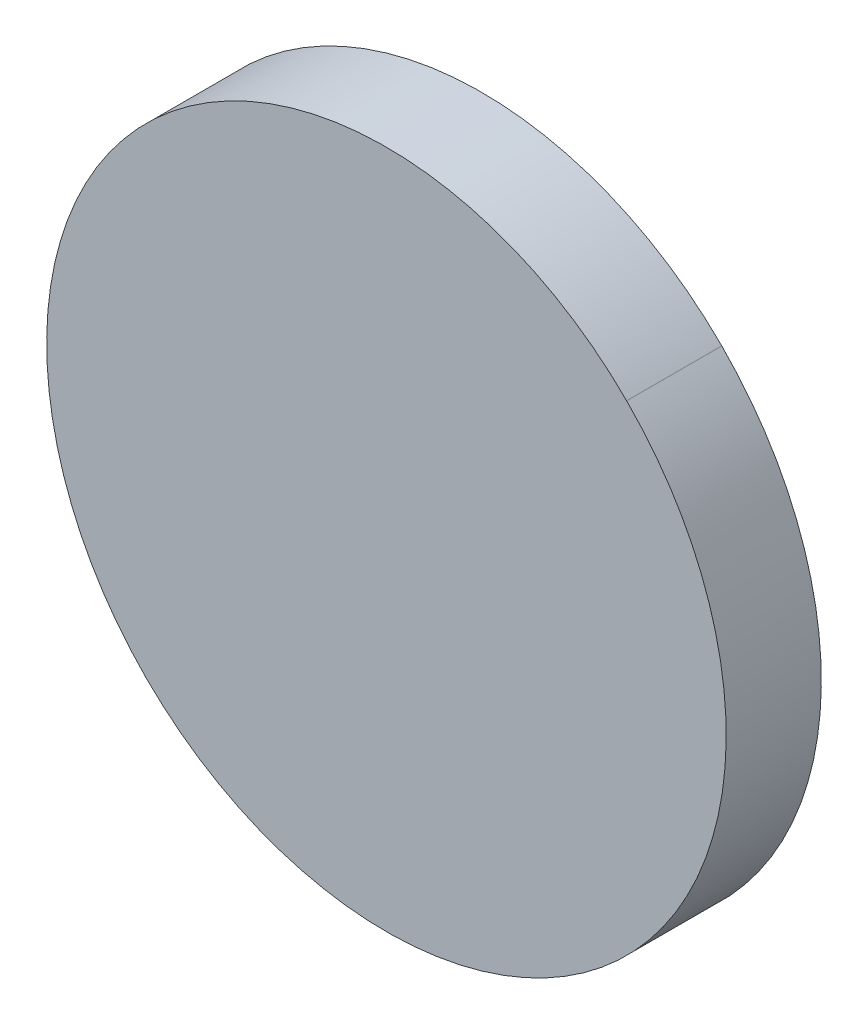
ISO-10303-21;
HEADER;
FILE_DESCRIPTION(('STEP AP214'),'2;1');
FILE_NAME('part.step','',(''),(''),'','','');
FILE_SCHEMA(('AUTOMOTIVE_DESIGN { 1 0 10303 214 1 1 1 1 }'));
ENDSEC;
DATA;
#1=APPLICATION_CONTEXT('core data for automotive mechanical design processes');
#2=APPLICATION_PROTOCOL_DEFINITION('international standard','automotive_design',2000,#1);
#3=PRODUCT_CONTEXT('',#1,'mechanical');
#4=PRODUCT('Part','Part','',(#3));
#5=PRODUCT_RELATED_PRODUCT_CATEGORY('part','',(#4));
#6=PRODUCT_DEFINITION_FORMATION('','',#4);
#7=PRODUCT_DEFINITION_CONTEXT('part definition',#1,'design');
#8=PRODUCT_DEFINITION('design','',#6,#7);
#9=PRODUCT_DEFINITION_SHAPE('','',#8);
#10=(LENGTH_UNIT() NAMED_UNIT(*) SI_UNIT(.MILLI.,.METRE.));
#11=(NAMED_UNIT(*) PLANE_ANGLE_UNIT() SI_UNIT($,.RADIAN.));
#12=(NAMED_UNIT(*) SI_UNIT($,.STERADIAN.) SOLID_ANGLE_UNIT());
#13=UNCERTAINTY_MEASURE_WITH_UNIT(LENGTH_MEASURE(1.E-05),#10,'distance_accuracy_value','');
#14=(GEOMETRIC_REPRESENTATION_CONTEXT(3) GLOBAL_UNCERTAINTY_ASSIGNED_CONTEXT((#13)) GLOBAL_UNIT_ASSIGNED_CONTEXT((#10,
#11,#12)) REPRESENTATION_CONTEXT('',''));
#15=CARTESIAN_POINT('',(0.,0.,0.));
#16=DIRECTION('',(0.,0.,1.));
#17=DIRECTION('',(1.,0.,0.));
#18=AXIS2_PLACEMENT_3D('',#15,#16,#17);
#19=CARTESIAN_POINT('',(93.32717174,92.59717066,0.));
#20=DIRECTION('',(0.707106781186548,0.707106781186548,0.));
#21=DIRECTION('',(0.707106781186548,-0.707106781186548,0.));
#22=AXIS2_PLACEMENT_3D('',#19,#20,#21);
#23=PLANE('',#22);
#24=DIRECTION('',(0.707106781186548,-0.707106781186548,0.));
#25=VECTOR('',#24,1.);
#26=CARTESIAN_POINT('',(93.32717174,92.59717066,0.03556));
#27=LINE('',#26,#25);
#28=CARTESIAN_POINT('',(93.32717174,92.59717066,0.03556));
#29=VERTEX_POINT('',#28);
#30=CARTESIAN_POINT('',(93.3272073,92.5971351,0.03556));
#31=VERTEX_POINT('',#30);
#32=EDGE_CURVE('E11',#29,#31,#27,.T.);
#33=ORIENTED_EDGE('',*,*,#32,.F.);
#34=DIRECTION('',(0.,0.,1.));
#35=VECTOR('',#34,1.);
#36=CARTESIAN_POINT('',(93.32717174,92.59717066,0.));
#37=LINE('',#36,#35);
#38=CARTESIAN_POINT('',(93.32717174,92.59717066,0.));
#39=VERTEX_POINT('',#38);
#40=EDGE_CURVE('E24',#39,#29,#37,.T.);
#41=ORIENTED_EDGE('',*,*,#40,.F.);
#42=DIRECTION('',(0.707106781186548,-0.707106781186548,0.));
#43=VECTOR('',#42,1.);
#44=CARTESIAN_POINT('',(93.32717174,92.59717066,0.));
#45=LINE('',#44,#43);
#46=CARTESIAN_POINT('',(93.3272073,92.5971351,0.));
#47=VERTEX_POINT('',#46);
#48=EDGE_CURVE('E75',#39,#47,#45,.T.);
#49=ORIENTED_EDGE('',*,*,#48,.T.);
#50=DIRECTION('',(0.,0.,1.));
#51=VECTOR('',#50,1.);
#52=CARTESIAN_POINT('',(93.3272073,92.5971351,0.));
#53=LINE('',#52,#51);
#54=EDGE_CURVE('E37',#47,#31,#53,.T.);
#55=ORIENTED_EDGE('',*,*,#54,.T.);
#56=EDGE_LOOP('',(#33,#41,#49,#55));
#57=FACE_BOUND('',#56,.T.);
#58=ADVANCED_FACE('F17',(#57),#23,.F.);
#59=CARTESIAN_POINT('',(93.417009,92.6869368,0.));
#60=DIRECTION('',(0.,0.,-1.));
#61=DIRECTION('',(-0.707106781186548,-0.707106781186548,0.));
#62=AXIS2_PLACEMENT_3D('',#59,#60,#61);
#63=CYLINDRICAL_SURFACE('',#62,0.126998782064167);
#64=CARTESIAN_POINT('',(93.417009,92.6869368,0.03556));
#65=DIRECTION('',(0.,0.,1.));
#66=DIRECTION('',(-0.707106781186548,-0.707106781186548,0.));
#67=AXIS2_PLACEMENT_3D('',#64,#65,#66);
#68=CIRCLE('',#67,0.126998782064167);
#69=CARTESIAN_POINT('',(93.5068107,92.7767385,0.03556));
#70=VERTEX_POINT('',#69);
#71=EDGE_CURVE('E83',#31,#70,#68,.T.);
#72=ORIENTED_EDGE('',*,*,#71,.F.);
#73=ORIENTED_EDGE('',*,*,#54,.F.);
#74=CARTESIAN_POINT('',(93.417009,92.6869368,0.));
#75=DIRECTION('',(0.,0.,1.));
#76=DIRECTION('',(-0.707106781186548,-0.707106781186548,0.));
#77=AXIS2_PLACEMENT_3D('',#74,#75,#76);
#78=CIRCLE('',#77,0.126998782064167);
#79=CARTESIAN_POINT('',(93.5068107,92.7767385,0.));
#80=VERTEX_POINT('',#79);
#81=EDGE_CURVE('E81',#47,#80,#78,.T.);
#82=ORIENTED_EDGE('',*,*,#81,.T.);
#83=DIRECTION('',(0.,0.,1.));
#84=VECTOR('',#83,1.);
#85=CARTESIAN_POINT('',(93.5068107,92.7767385,0.));
#86=LINE('',#85,#84);
#87=EDGE_CURVE('E67',#80,#70,#86,.T.);
#88=ORIENTED_EDGE('',*,*,#87,.T.);
#89=EDGE_LOOP('',(#72,#73,#82,#88));
#90=FACE_BOUND('',#89,.T.);
#91=ADVANCED_FACE('F89',(#90),#63,.T.);
#92=CARTESIAN_POINT('',(93.5068107,92.7767385,0.));
#93=DIRECTION('',(-0.707106781186548,-0.707106781186548,0.));
#94=DIRECTION('',(-0.707106781186548,0.707106781186548,0.));
#95=AXIS2_PLACEMENT_3D('',#92,#93,#94);
#96=PLANE('',#95);
#97=DIRECTION('',(-0.707106781186548,0.707106781186548,0.));
#98=VECTOR('',#97,1.);
#99=CARTESIAN_POINT('',(93.5068107,92.7767385,0.03556));
#100=LINE('',#99,#98);
#101=CARTESIAN_POINT('',(93.50677514,92.77677406,0.03556));
#102=VERTEX_POINT('',#101);
#103=EDGE_CURVE('E71',#70,#102,#100,.T.);
#104=ORIENTED_EDGE('',*,*,#103,.F.);
#105=ORIENTED_EDGE('',*,*,#87,.F.);
#106=DIRECTION('',(-0.707106781186548,0.707106781186548,0.));
#107=VECTOR('',#106,1.);
#108=CARTESIAN_POINT('',(93.5068107,92.7767385,0.));
#109=LINE('',#108,#107);
#110=CARTESIAN_POINT('',(93.50677514,92.77677406,0.));
#111=VERTEX_POINT('',#110);
#112=EDGE_CURVE('E63',#80,#111,#109,.T.);
#113=ORIENTED_EDGE('',*,*,#112,.T.);
#114=DIRECTION('',(0.,0.,1.));
#115=VECTOR('',#114,1.);
#116=CARTESIAN_POINT('',(93.50677514,92.77677406,0.));
#117=LINE('',#116,#115);
#118=EDGE_CURVE('E53',#111,#102,#117,.T.);
#119=ORIENTED_EDGE('',*,*,#118,.T.);
#120=EDGE_LOOP('',(#104,#105,#113,#119));
#121=FACE_BOUND('',#120,.T.);
#122=ADVANCED_FACE('F66',(#121),#96,.F.);
#123=CARTESIAN_POINT('',(93.41697344,92.68697236,0.));
#124=DIRECTION('',(0.,0.,-1.));
#125=DIRECTION('',(0.707106781186548,0.707106781186548,0.));
#126=AXIS2_PLACEMENT_3D('',#123,#124,#125);
#127=CYLINDRICAL_SURFACE('',#126,0.126998782064167);
#128=CARTESIAN_POINT('',(93.41697344,92.68697236,0.03556));
#129=DIRECTION('',(0.,0.,1.));
#130=DIRECTION('',(0.707106781186548,0.707106781186548,0.));
#131=AXIS2_PLACEMENT_3D('',#128,#129,#130);
#132=CIRCLE('',#131,0.126998782064167);
#133=EDGE_CURVE('E59',#102,#29,#132,.T.);
#134=ORIENTED_EDGE('',*,*,#133,.F.);
#135=ORIENTED_EDGE('',*,*,#118,.F.);
#136=CARTESIAN_POINT('',(93.41697344,92.68697236,0.));
#137=DIRECTION('',(0.,0.,1.));
#138=DIRECTION('',(0.707106781186548,0.707106781186548,0.));
#139=AXIS2_PLACEMENT_3D('',#136,#137,#138);
#140=CIRCLE('',#139,0.126998782064167);
#141=EDGE_CURVE('E57',#111,#39,#140,.T.);
#142=ORIENTED_EDGE('',*,*,#141,.T.);
#143=ORIENTED_EDGE('',*,*,#40,.T.);
#144=EDGE_LOOP('',(#134,#135,#142,#143));
#145=FACE_BOUND('',#144,.T.);
#146=ADVANCED_FACE('F55',(#145),#127,.T.);
#147=CARTESIAN_POINT('',(93.32717174,92.59717066,0.));
#148=DIRECTION('',(0.,0.,-1.));
#149=DIRECTION('',(-1.,0.,0.));
#150=AXIS2_PLACEMENT_3D('',#147,#148,#149);
#151=PLANE('',#150);
#152=ORIENTED_EDGE('',*,*,#141,.F.);
#153=ORIENTED_EDGE('',*,*,#112,.F.);
#154=ORIENTED_EDGE('',*,*,#81,.F.);
#155=ORIENTED_EDGE('',*,*,#48,.F.);
#156=EDGE_LOOP('',(#152,#153,#154,#155));
#157=FACE_BOUND('',#156,.T.);
#158=ADVANCED_FACE('F74',(#157),#151,.T.);
#159=CARTESIAN_POINT('',(93.32717174,92.59717066,0.03556));
#160=DIRECTION('',(0.,0.,-1.));
#161=DIRECTION('',(-1.,0.,0.));
#162=AXIS2_PLACEMENT_3D('',#159,#160,#161);
#163=PLANE('',#162);
#164=ORIENTED_EDGE('',*,*,#32,.T.);
#165=ORIENTED_EDGE('',*,*,#71,.T.);
#166=ORIENTED_EDGE('',*,*,#103,.T.);
#167=ORIENTED_EDGE('',*,*,#133,.T.);
#168=EDGE_LOOP('',(#164,#165,#166,#167));
#169=FACE_BOUND('',#168,.T.);
#170=ADVANCED_FACE('F91',(#169),#163,.F.);
#171=CLOSED_SHELL('',(#58,#91,#122,#146,#158,#170));
#172=MANIFOLD_SOLID_BREP('B1',#171);
#173=ADVANCED_BREP_SHAPE_REPRESENTATION('',(#18,#172),#14);
#174=SHAPE_DEFINITION_REPRESENTATION(#9,#173);
ENDSEC;
END-ISO-10303-21;
